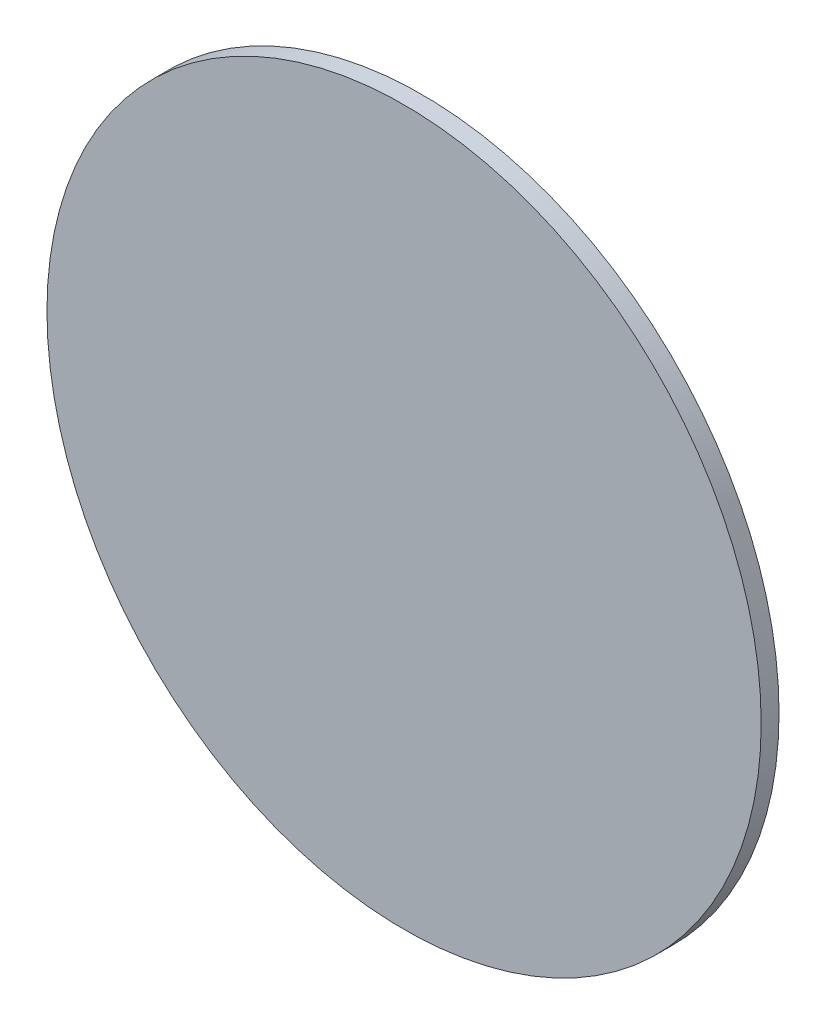
ISO-10303-21;
HEADER;
FILE_DESCRIPTION(('STEP AP214'),'2;1');
FILE_NAME('part.step','',(''),(''),'','','');
FILE_SCHEMA(('AUTOMOTIVE_DESIGN { 1 0 10303 214 1 1 1 1 }'));
ENDSEC;
DATA;
#1=APPLICATION_CONTEXT('core data for automotive mechanical design processes');
#2=APPLICATION_PROTOCOL_DEFINITION('international standard','automotive_design',2000,#1);
#3=PRODUCT_CONTEXT('',#1,'mechanical');
#4=PRODUCT('Part','Part','',(#3));
#5=PRODUCT_RELATED_PRODUCT_CATEGORY('part','',(#4));
#6=PRODUCT_DEFINITION_FORMATION('','',#4);
#7=PRODUCT_DEFINITION_CONTEXT('part definition',#1,'design');
#8=PRODUCT_DEFINITION('design','',#6,#7);
#9=PRODUCT_DEFINITION_SHAPE('','',#8);
#10=(LENGTH_UNIT() NAMED_UNIT(*) SI_UNIT(.MILLI.,.METRE.));
#11=(NAMED_UNIT(*) PLANE_ANGLE_UNIT() SI_UNIT($,.RADIAN.));
#12=(NAMED_UNIT(*) SI_UNIT($,.STERADIAN.) SOLID_ANGLE_UNIT());
#13=UNCERTAINTY_MEASURE_WITH_UNIT(LENGTH_MEASURE(1.E-05),#10,'distance_accuracy_value','');
#14=(GEOMETRIC_REPRESENTATION_CONTEXT(3) GLOBAL_UNCERTAINTY_ASSIGNED_CONTEXT((#13)) GLOBAL_UNIT_ASSIGNED_CONTEXT((#10,
#11,#12)) REPRESENTATION_CONTEXT('',''));
#15=CARTESIAN_POINT('',(0.,0.,0.));
#16=DIRECTION('',(0.,0.,1.));
#17=DIRECTION('',(1.,0.,0.));
#18=AXIS2_PLACEMENT_3D('',#15,#16,#17);
#19=CARTESIAN_POINT('',(0.2,0.,0.01));
#20=DIRECTION('',(0.,0.,-1.));
#21=DIRECTION('',(-1.,0.,0.));
#22=AXIS2_PLACEMENT_3D('',#19,#20,#21);
#23=PLANE('',#22);
#24=CARTESIAN_POINT('',(0.,0.,0.01));
#25=DIRECTION('',(0.,0.,-1.));
#26=DIRECTION('',(-1.,0.,0.));
#27=AXIS2_PLACEMENT_3D('',#24,#25,#26);
#28=CIRCLE('',#27,0.2);
#29=CARTESIAN_POINT('',(-0.2,0.,0.01));
#30=VERTEX_POINT('',#29);
#31=EDGE_CURVE('E18',#30,#30,#28,.T.);
#32=ORIENTED_EDGE('',*,*,#31,.F.);
#33=EDGE_LOOP('',(#32));
#34=FACE_BOUND('',#33,.T.);
#35=ADVANCED_FACE('F15',(#34),#23,.F.);
#36=CARTESIAN_POINT('',(0.,0.,0.));
#37=DIRECTION('',(0.,0.,-1.));
#38=DIRECTION('',(-1.,0.,0.));
#39=AXIS2_PLACEMENT_3D('',#36,#37,#38);
#40=CYLINDRICAL_SURFACE('',#39,0.2);
#41=CARTESIAN_POINT('',(0.,0.,0.));
#42=DIRECTION('',(0.,0.,-1.));
#43=DIRECTION('',(-1.,0.,0.));
#44=AXIS2_PLACEMENT_3D('',#41,#42,#43);
#45=CIRCLE('',#44,0.2);
#46=CARTESIAN_POINT('',(-0.2,0.,0.));
#47=VERTEX_POINT('',#46);
#48=EDGE_CURVE('E10',#47,#47,#45,.T.);
#49=ORIENTED_EDGE('',*,*,#48,.F.);
#50=EDGE_LOOP('',(#49));
#51=FACE_BOUND('',#50,.T.);
#52=ORIENTED_EDGE('',*,*,#31,.T.);
#53=EDGE_LOOP('',(#52));
#54=FACE_BOUND('',#53,.T.);
#55=ADVANCED_FACE('F27',(#51,#54),#40,.T.);
#56=CARTESIAN_POINT('',(0.2,0.,0.));
#57=DIRECTION('',(0.,0.,-1.));
#58=DIRECTION('',(-1.,0.,0.));
#59=AXIS2_PLACEMENT_3D('',#56,#57,#58);
#60=PLANE('',#59);
#61=ORIENTED_EDGE('',*,*,#48,.T.);
#62=EDGE_LOOP('',(#61));
#63=FACE_BOUND('',#62,.T.);
#64=ADVANCED_FACE('F34',(#63),#60,.T.);
#65=CLOSED_SHELL('',(#35,#55,#64));
#66=MANIFOLD_SOLID_BREP('B1',#65);
#67=ADVANCED_BREP_SHAPE_REPRESENTATION('',(#18,#66),#14);
#68=SHAPE_DEFINITION_REPRESENTATION(#9,#67);
ENDSEC;
END-ISO-10303-21;
